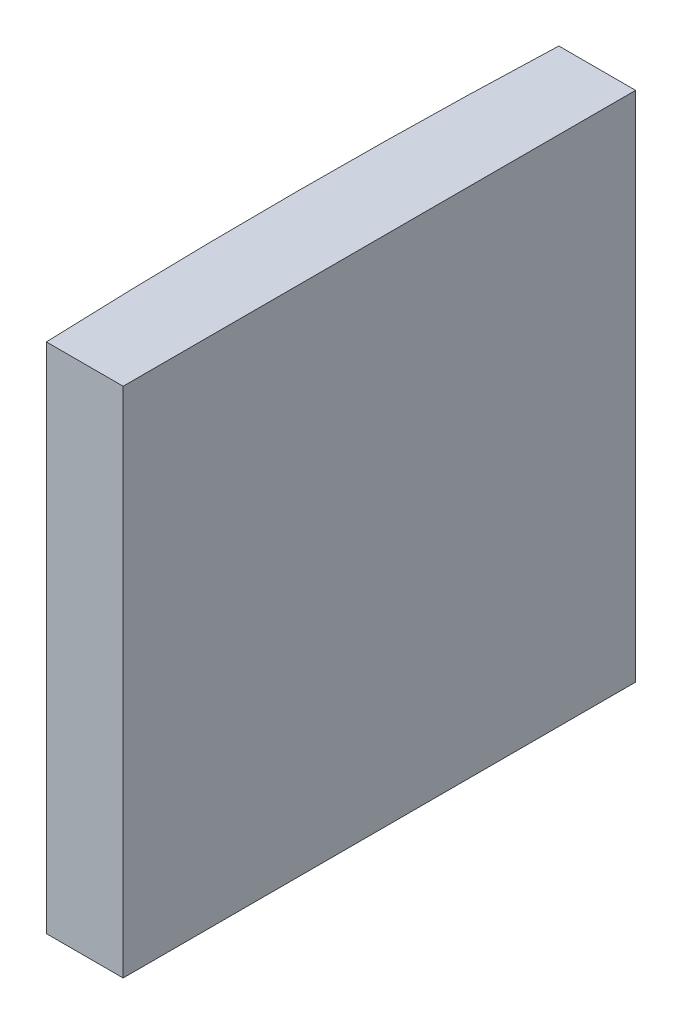
ISO-10303-21;
HEADER;
FILE_DESCRIPTION(('STEP AP214'),'2;1');
FILE_NAME('part.step','',(''),(''),'','','');
FILE_SCHEMA(('AUTOMOTIVE_DESIGN { 1 0 10303 214 1 1 1 1 }'));
ENDSEC;
DATA;
#1=APPLICATION_CONTEXT('core data for automotive mechanical design processes');
#2=APPLICATION_PROTOCOL_DEFINITION('international standard','automotive_design',2000,#1);
#3=PRODUCT_CONTEXT('',#1,'mechanical');
#4=PRODUCT('Part','Part','',(#3));
#5=PRODUCT_RELATED_PRODUCT_CATEGORY('part','',(#4));
#6=PRODUCT_DEFINITION_FORMATION('','',#4);
#7=PRODUCT_DEFINITION_CONTEXT('part definition',#1,'design');
#8=PRODUCT_DEFINITION('design','',#6,#7);
#9=PRODUCT_DEFINITION_SHAPE('','',#8);
#10=(LENGTH_UNIT() NAMED_UNIT(*) SI_UNIT(.MILLI.,.METRE.));
#11=(NAMED_UNIT(*) PLANE_ANGLE_UNIT() SI_UNIT($,.RADIAN.));
#12=(NAMED_UNIT(*) SI_UNIT($,.STERADIAN.) SOLID_ANGLE_UNIT());
#13=UNCERTAINTY_MEASURE_WITH_UNIT(LENGTH_MEASURE(1.E-05),#10,'distance_accuracy_value','');
#14=(GEOMETRIC_REPRESENTATION_CONTEXT(3) GLOBAL_UNCERTAINTY_ASSIGNED_CONTEXT((#13)) GLOBAL_UNIT_ASSIGNED_CONTEXT((#10,
#11,#12)) REPRESENTATION_CONTEXT('',''));
#15=CARTESIAN_POINT('',(0.,0.,0.));
#16=DIRECTION('',(0.,0.,1.));
#17=DIRECTION('',(1.,0.,0.));
#18=AXIS2_PLACEMENT_3D('',#15,#16,#17);
#19=CARTESIAN_POINT('',(4.35520433485127,20.,0.));
#20=DIRECTION('',(0.,-1.,0.));
#21=DIRECTION('',(0.,0.,-1.));
#22=AXIS2_PLACEMENT_3D('',#19,#20,#21);
#23=CYLINDRICAL_SURFACE('',#22,258.5);
#24=CARTESIAN_POINT('',(4.35520433485127,0.,0.));
#25=DIRECTION('',(0.,1.,0.));
#26=DIRECTION('',(0.,0.,1.));
#27=AXIS2_PLACEMENT_3D('',#24,#25,#26);
#28=CIRCLE('',#27,258.5);
#29=CARTESIAN_POINT('',(-253.951299648304,0.,-10.));
#30=VERTEX_POINT('',#29);
#31=CARTESIAN_POINT('',(-253.951299648304,0.,10.));
#32=VERTEX_POINT('',#31);
#33=EDGE_CURVE('E100',#30,#32,#28,.T.);
#34=ORIENTED_EDGE('',*,*,#33,.T.);
#35=DIRECTION('',(0.,-1.,0.));
#36=VECTOR('',#35,1.);
#37=CARTESIAN_POINT('',(-253.951299648304,20.,10.));
#38=LINE('',#37,#36);
#39=CARTESIAN_POINT('',(-253.951299648304,20.,10.));
#40=VERTEX_POINT('',#39);
#41=EDGE_CURVE('E11',#40,#32,#38,.T.);
#42=ORIENTED_EDGE('',*,*,#41,.F.);
#43=CARTESIAN_POINT('',(4.35520433485127,20.,0.));
#44=DIRECTION('',(0.,1.,0.));
#45=DIRECTION('',(0.,0.,1.));
#46=AXIS2_PLACEMENT_3D('',#43,#44,#45);
#47=CIRCLE('',#46,258.5);
#48=CARTESIAN_POINT('',(-253.951299648304,20.,-10.));
#49=VERTEX_POINT('',#48);
#50=EDGE_CURVE('E88',#49,#40,#47,.T.);
#51=ORIENTED_EDGE('',*,*,#50,.F.);
#52=DIRECTION('',(0.,-1.,0.));
#53=VECTOR('',#52,1.);
#54=CARTESIAN_POINT('',(-253.951299648304,20.,-10.));
#55=LINE('',#54,#53);
#56=EDGE_CURVE('E96',#49,#30,#55,.T.);
#57=ORIENTED_EDGE('',*,*,#56,.T.);
#58=EDGE_LOOP('',(#34,#42,#51,#57));
#59=FACE_BOUND('',#58,.T.);
#60=ADVANCED_FACE('F37',(#59),#23,.T.);
#61=CARTESIAN_POINT('',(-253.951299648304,20.,10.));
#62=DIRECTION('',(0.,0.,-1.));
#63=DIRECTION('',(-1.,0.,0.));
#64=AXIS2_PLACEMENT_3D('',#61,#62,#63);
#65=PLANE('',#64);
#66=DIRECTION('',(1.,0.,0.));
#67=VECTOR('',#66,1.);
#68=CARTESIAN_POINT('',(-253.951299648304,0.,10.));
#69=LINE('',#68,#67);
#70=CARTESIAN_POINT('',(-250.954795665149,0.,10.));
#71=VERTEX_POINT('',#70);
#72=EDGE_CURVE('E92',#32,#71,#69,.T.);
#73=ORIENTED_EDGE('',*,*,#72,.T.);
#74=DIRECTION('',(0.,-1.,0.));
#75=VECTOR('',#74,1.);
#76=CARTESIAN_POINT('',(-250.954795665149,20.,10.));
#77=LINE('',#76,#75);
#78=CARTESIAN_POINT('',(-250.954795665149,20.,10.));
#79=VERTEX_POINT('',#78);
#80=EDGE_CURVE('E45',#79,#71,#77,.T.);
#81=ORIENTED_EDGE('',*,*,#80,.F.);
#82=DIRECTION('',(1.,0.,0.));
#83=VECTOR('',#82,1.);
#84=CARTESIAN_POINT('',(-253.951299648304,20.,10.));
#85=LINE('',#84,#83);
#86=EDGE_CURVE('E83',#40,#79,#85,.T.);
#87=ORIENTED_EDGE('',*,*,#86,.F.);
#88=ORIENTED_EDGE('',*,*,#41,.T.);
#89=EDGE_LOOP('',(#73,#81,#87,#88));
#90=FACE_BOUND('',#89,.T.);
#91=ADVANCED_FACE('F91',(#90),#65,.F.);
#92=CARTESIAN_POINT('',(-250.954795665149,20.,-10.));
#93=DIRECTION('',(-1.,0.,0.));
#94=DIRECTION('',(0.,0.,1.));
#95=AXIS2_PLACEMENT_3D('',#92,#93,#94);
#96=PLANE('',#95);
#97=DIRECTION('',(0.,0.,-1.));
#98=VECTOR('',#97,1.);
#99=CARTESIAN_POINT('',(-250.954795665149,0.,-10.));
#100=LINE('',#99,#98);
#101=CARTESIAN_POINT('',(-250.954795665149,0.,-10.));
#102=VERTEX_POINT('',#101);
#103=EDGE_CURVE('E70',#71,#102,#100,.T.);
#104=ORIENTED_EDGE('',*,*,#103,.T.);
#105=DIRECTION('',(0.,-1.,0.));
#106=VECTOR('',#105,1.);
#107=CARTESIAN_POINT('',(-250.954795665149,20.,-10.));
#108=LINE('',#107,#106);
#109=CARTESIAN_POINT('',(-250.954795665149,20.,-10.));
#110=VERTEX_POINT('',#109);
#111=EDGE_CURVE('E93',#110,#102,#108,.T.);
#112=ORIENTED_EDGE('',*,*,#111,.F.);
#113=DIRECTION('',(0.,0.,-1.));
#114=VECTOR('',#113,1.);
#115=CARTESIAN_POINT('',(-250.954795665149,20.,-10.));
#116=LINE('',#115,#114);
#117=EDGE_CURVE('E86',#79,#110,#116,.T.);
#118=ORIENTED_EDGE('',*,*,#117,.F.);
#119=ORIENTED_EDGE('',*,*,#80,.T.);
#120=EDGE_LOOP('',(#104,#112,#118,#119));
#121=FACE_BOUND('',#120,.T.);
#122=ADVANCED_FACE('F94',(#121),#96,.F.);
#123=CARTESIAN_POINT('',(-253.951299648304,20.,-10.));
#124=DIRECTION('',(0.,0.,1.));
#125=DIRECTION('',(1.,0.,0.));
#126=AXIS2_PLACEMENT_3D('',#123,#124,#125);
#127=PLANE('',#126);
#128=DIRECTION('',(-1.,0.,0.));
#129=VECTOR('',#128,1.);
#130=CARTESIAN_POINT('',(-253.951299648304,0.,-10.));
#131=LINE('',#130,#129);
#132=EDGE_CURVE('E76',#102,#30,#131,.T.);
#133=ORIENTED_EDGE('',*,*,#132,.T.);
#134=ORIENTED_EDGE('',*,*,#56,.F.);
#135=DIRECTION('',(-1.,0.,0.));
#136=VECTOR('',#135,1.);
#137=CARTESIAN_POINT('',(-253.951299648304,20.,-10.));
#138=LINE('',#137,#136);
#139=EDGE_CURVE('E53',#110,#49,#138,.T.);
#140=ORIENTED_EDGE('',*,*,#139,.F.);
#141=ORIENTED_EDGE('',*,*,#111,.T.);
#142=EDGE_LOOP('',(#133,#134,#140,#141));
#143=FACE_BOUND('',#142,.T.);
#144=ADVANCED_FACE('F107',(#143),#127,.F.);
#145=CARTESIAN_POINT('',(4.35520433485127,20.,0.));
#146=DIRECTION('',(0.,1.,0.));
#147=DIRECTION('',(0.,0.,1.));
#148=AXIS2_PLACEMENT_3D('',#145,#146,#147);
#149=PLANE('',#148);
#150=ORIENTED_EDGE('',*,*,#50,.T.);
#151=ORIENTED_EDGE('',*,*,#86,.T.);
#152=ORIENTED_EDGE('',*,*,#117,.T.);
#153=ORIENTED_EDGE('',*,*,#139,.T.);
#154=EDGE_LOOP('',(#150,#151,#152,#153));
#155=FACE_BOUND('',#154,.T.);
#156=ADVANCED_FACE('F84',(#155),#149,.T.);
#157=CARTESIAN_POINT('',(4.35520433485127,0.,0.));
#158=DIRECTION('',(0.,1.,0.));
#159=DIRECTION('',(0.,0.,1.));
#160=AXIS2_PLACEMENT_3D('',#157,#158,#159);
#161=PLANE('',#160);
#162=ORIENTED_EDGE('',*,*,#33,.F.);
#163=ORIENTED_EDGE('',*,*,#132,.F.);
#164=ORIENTED_EDGE('',*,*,#103,.F.);
#165=ORIENTED_EDGE('',*,*,#72,.F.);
#166=EDGE_LOOP('',(#162,#163,#164,#165));
#167=FACE_BOUND('',#166,.T.);
#168=ADVANCED_FACE('F110',(#167),#161,.F.);
#169=CLOSED_SHELL('',(#60,#91,#122,#144,#156,#168));
#170=MANIFOLD_SOLID_BREP('B2',#169);
#171=ADVANCED_BREP_SHAPE_REPRESENTATION('',(#18,#170),#14);
#172=SHAPE_DEFINITION_REPRESENTATION(#9,#171);
ENDSEC;
END-ISO-10303-21;
